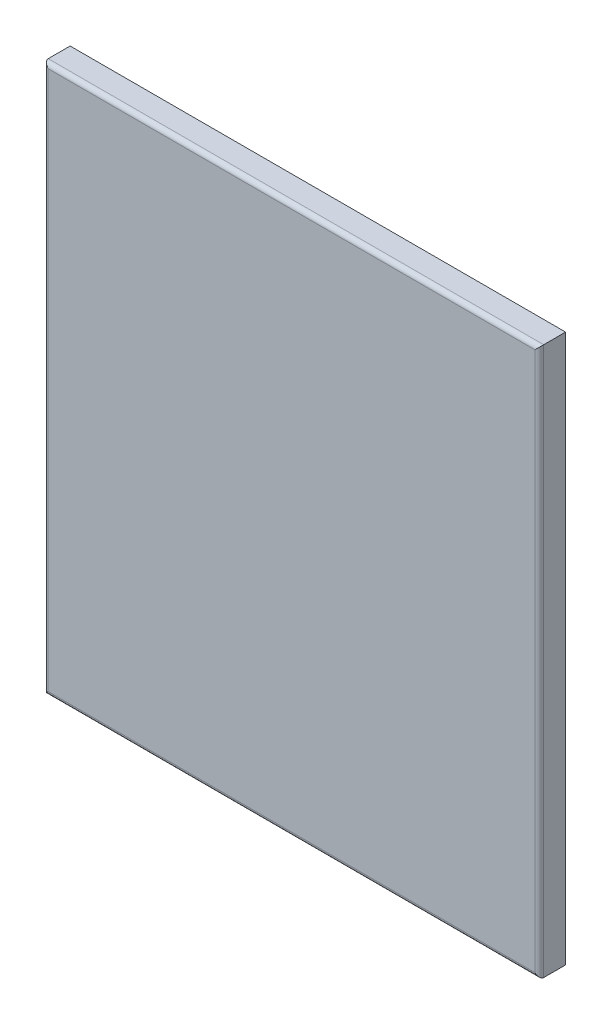
ISO-10303-21;
HEADER;
FILE_DESCRIPTION(('STEP AP214'),'2;1');
FILE_NAME('part.step','',(''),(''),'','','');
FILE_SCHEMA(('AUTOMOTIVE_DESIGN { 1 0 10303 214 1 1 1 1 }'));
ENDSEC;
DATA;
#1=APPLICATION_CONTEXT('core data for automotive mechanical design processes');
#2=APPLICATION_PROTOCOL_DEFINITION('international standard','automotive_design',2000,#1);
#3=PRODUCT_CONTEXT('',#1,'mechanical');
#4=PRODUCT('Part','Part','',(#3));
#5=PRODUCT_RELATED_PRODUCT_CATEGORY('part','',(#4));
#6=PRODUCT_DEFINITION_FORMATION('','',#4);
#7=PRODUCT_DEFINITION_CONTEXT('part definition',#1,'design');
#8=PRODUCT_DEFINITION('design','',#6,#7);
#9=PRODUCT_DEFINITION_SHAPE('','',#8);
#10=(LENGTH_UNIT() NAMED_UNIT(*) SI_UNIT(.MILLI.,.METRE.));
#11=(NAMED_UNIT(*) PLANE_ANGLE_UNIT() SI_UNIT($,.RADIAN.));
#12=(NAMED_UNIT(*) SI_UNIT($,.STERADIAN.) SOLID_ANGLE_UNIT());
#13=UNCERTAINTY_MEASURE_WITH_UNIT(LENGTH_MEASURE(1.E-05),#10,'distance_accuracy_value','');
#14=(GEOMETRIC_REPRESENTATION_CONTEXT(3) GLOBAL_UNCERTAINTY_ASSIGNED_CONTEXT((#13)) GLOBAL_UNIT_ASSIGNED_CONTEXT((#10,
#11,#12)) REPRESENTATION_CONTEXT('',''));
#15=CARTESIAN_POINT('',(0.,0.,0.));
#16=DIRECTION('',(0.,0.,1.));
#17=DIRECTION('',(1.,0.,0.));
#18=AXIS2_PLACEMENT_3D('',#15,#16,#17);
#19=CARTESIAN_POINT('',(0.,0.,0.));
#20=DIRECTION('',(0.,0.,-1.));
#21=DIRECTION('',(-1.,0.,0.));
#22=AXIS2_PLACEMENT_3D('',#19,#20,#21);
#23=PLANE('',#22);
#24=DIRECTION('',(1.,0.,0.));
#25=VECTOR('',#24,1.);
#26=CARTESIAN_POINT('',(717.55,0.,0.));
#27=LINE('',#26,#25);
#28=CARTESIAN_POINT('',(0.,0.,0.));
#29=VERTEX_POINT('',#28);
#30=CARTESIAN_POINT('',(717.55,0.,0.));
#31=VERTEX_POINT('',#30);
#32=EDGE_CURVE('E225',#29,#31,#27,.T.);
#33=ORIENTED_EDGE('',*,*,#32,.F.);
#34=DIRECTION('',(0.,-1.,0.));
#35=VECTOR('',#34,1.);
#36=CARTESIAN_POINT('',(0.,0.,0.));
#37=LINE('',#36,#35);
#38=CARTESIAN_POINT('',(0.,793.75,0.));
#39=VERTEX_POINT('',#38);
#40=EDGE_CURVE('E245',#39,#29,#37,.T.);
#41=ORIENTED_EDGE('',*,*,#40,.F.);
#42=DIRECTION('',(-1.,0.,0.));
#43=VECTOR('',#42,1.);
#44=CARTESIAN_POINT('',(0.,793.75,0.));
#45=LINE('',#44,#43);
#46=CARTESIAN_POINT('',(717.55,793.75,0.));
#47=VERTEX_POINT('',#46);
#48=EDGE_CURVE('E238',#47,#39,#45,.T.);
#49=ORIENTED_EDGE('',*,*,#48,.F.);
#50=DIRECTION('',(0.,1.,0.));
#51=VECTOR('',#50,1.);
#52=CARTESIAN_POINT('',(717.55,793.75,0.));
#53=LINE('',#52,#51);
#54=EDGE_CURVE('E231',#31,#47,#53,.T.);
#55=ORIENTED_EDGE('',*,*,#54,.F.);
#56=EDGE_LOOP('',(#33,#41,#49,#55));
#57=FACE_BOUND('',#56,.T.);
#58=DIRECTION('',(1.,0.,0.));
#59=VECTOR('',#58,1.);
#60=CARTESIAN_POINT('',(0.,25.4,0.));
#61=LINE('',#60,#59);
#62=CARTESIAN_POINT('',(25.4,25.4,0.));
#63=VERTEX_POINT('',#62);
#64=CARTESIAN_POINT('',(692.15,25.4,0.));
#65=VERTEX_POINT('',#64);
#66=EDGE_CURVE('E182',#63,#65,#61,.T.);
#67=ORIENTED_EDGE('',*,*,#66,.T.);
#68=DIRECTION('',(0.,1.,0.));
#69=VECTOR('',#68,1.);
#70=CARTESIAN_POINT('',(692.15,0.,0.));
#71=LINE('',#70,#69);
#72=CARTESIAN_POINT('',(692.15,768.35,0.));
#73=VERTEX_POINT('',#72);
#74=EDGE_CURVE('E173',#65,#73,#71,.T.);
#75=ORIENTED_EDGE('',*,*,#74,.T.);
#76=DIRECTION('',(-1.,0.,0.));
#77=VECTOR('',#76,1.);
#78=CARTESIAN_POINT('',(0.,768.35,0.));
#79=LINE('',#78,#77);
#80=CARTESIAN_POINT('',(25.4,768.35,0.));
#81=VERTEX_POINT('',#80);
#82=EDGE_CURVE('E155',#73,#81,#79,.T.);
#83=ORIENTED_EDGE('',*,*,#82,.T.);
#84=DIRECTION('',(0.,-1.,0.));
#85=VECTOR('',#84,1.);
#86=CARTESIAN_POINT('',(25.4,0.,0.));
#87=LINE('',#86,#85);
#88=EDGE_CURVE('E167',#81,#63,#87,.T.);
#89=ORIENTED_EDGE('',*,*,#88,.T.);
#90=EDGE_LOOP('',(#67,#75,#83,#89));
#91=FACE_BOUND('',#90,.T.);
#92=ADVANCED_FACE('F41',(#57,#91),#23,.T.);
#93=CARTESIAN_POINT('',(717.55,0.,38.1));
#94=DIRECTION('',(0.,1.,0.));
#95=DIRECTION('',(-1.,0.,0.));
#96=AXIS2_PLACEMENT_3D('',#93,#94,#95);
#97=PLANE('',#96);
#98=DIRECTION('',(0.,0.,-1.));
#99=VECTOR('',#98,1.);
#100=CARTESIAN_POINT('',(717.55,0.,38.1));
#101=LINE('',#100,#99);
#102=CARTESIAN_POINT('',(717.55,0.,31.75));
#103=VERTEX_POINT('',#102);
#104=EDGE_CURVE('E168',#103,#31,#101,.T.);
#105=ORIENTED_EDGE('',*,*,#104,.F.);
#106=DIRECTION('',(1.,0.,0.));
#107=VECTOR('',#106,1.);
#108=CARTESIAN_POINT('',(717.55,0.,31.75));
#109=LINE('',#108,#107);
#110=CARTESIAN_POINT('',(0.,0.,31.75));
#111=VERTEX_POINT('',#110);
#112=EDGE_CURVE('E203',#103,#111,#109,.F.);
#113=ORIENTED_EDGE('',*,*,#112,.T.);
#114=DIRECTION('',(0.,0.,-1.));
#115=VECTOR('',#114,1.);
#116=CARTESIAN_POINT('',(0.,0.,38.1));
#117=LINE('',#116,#115);
#118=EDGE_CURVE('E249',#111,#29,#117,.T.);
#119=ORIENTED_EDGE('',*,*,#118,.T.);
#120=ORIENTED_EDGE('',*,*,#32,.T.);
#121=EDGE_LOOP('',(#105,#113,#119,#120));
#122=FACE_BOUND('',#121,.T.);
#123=ADVANCED_FACE('F403',(#122),#97,.F.);
#124=CARTESIAN_POINT('',(717.55,793.75,38.1));
#125=DIRECTION('',(-1.,0.,0.));
#126=DIRECTION('',(0.,-1.,0.));
#127=AXIS2_PLACEMENT_3D('',#124,#125,#126);
#128=PLANE('',#127);
#129=DIRECTION('',(0.,0.,-1.));
#130=VECTOR('',#129,1.);
#131=CARTESIAN_POINT('',(717.55,793.75,38.1));
#132=LINE('',#131,#130);
#133=CARTESIAN_POINT('',(717.55,793.75,31.75));
#134=VERTEX_POINT('',#133);
#135=EDGE_CURVE('E255',#134,#47,#132,.T.);
#136=ORIENTED_EDGE('',*,*,#135,.F.);
#137=DIRECTION('',(0.,1.,0.));
#138=VECTOR('',#137,1.);
#139=CARTESIAN_POINT('',(717.55,793.75,31.75));
#140=LINE('',#139,#138);
#141=EDGE_CURVE('E51',#134,#103,#140,.F.);
#142=ORIENTED_EDGE('',*,*,#141,.T.);
#143=ORIENTED_EDGE('',*,*,#104,.T.);
#144=ORIENTED_EDGE('',*,*,#54,.T.);
#145=EDGE_LOOP('',(#136,#142,#143,#144));
#146=FACE_BOUND('',#145,.T.);
#147=ADVANCED_FACE('F409',(#146),#128,.F.);
#148=CARTESIAN_POINT('',(0.,793.75,38.1));
#149=DIRECTION('',(0.,-1.,0.));
#150=DIRECTION('',(0.,0.,-1.));
#151=AXIS2_PLACEMENT_3D('',#148,#149,#150);
#152=PLANE('',#151);
#153=DIRECTION('',(0.,0.,-1.));
#154=VECTOR('',#153,1.);
#155=CARTESIAN_POINT('',(0.,793.75,38.1));
#156=LINE('',#155,#154);
#157=CARTESIAN_POINT('',(0.,793.75,31.75));
#158=VERTEX_POINT('',#157);
#159=EDGE_CURVE('E252',#158,#39,#156,.T.);
#160=ORIENTED_EDGE('',*,*,#159,.F.);
#161=DIRECTION('',(-1.,0.,0.));
#162=VECTOR('',#161,1.);
#163=CARTESIAN_POINT('',(0.,793.75,31.75));
#164=LINE('',#163,#162);
#165=EDGE_CURVE('E11',#158,#134,#164,.F.);
#166=ORIENTED_EDGE('',*,*,#165,.T.);
#167=ORIENTED_EDGE('',*,*,#135,.T.);
#168=ORIENTED_EDGE('',*,*,#48,.T.);
#169=EDGE_LOOP('',(#160,#166,#167,#168));
#170=FACE_BOUND('',#169,.T.);
#171=ADVANCED_FACE('F418',(#170),#152,.F.);
#172=CARTESIAN_POINT('',(0.,0.,38.1));
#173=DIRECTION('',(1.,0.,0.));
#174=DIRECTION('',(0.,0.,-1.));
#175=AXIS2_PLACEMENT_3D('',#172,#173,#174);
#176=PLANE('',#175);
#177=ORIENTED_EDGE('',*,*,#118,.F.);
#178=DIRECTION('',(0.,-1.,0.));
#179=VECTOR('',#178,1.);
#180=CARTESIAN_POINT('',(0.,0.,31.75));
#181=LINE('',#180,#179);
#182=EDGE_CURVE('E65',#111,#158,#181,.F.);
#183=ORIENTED_EDGE('',*,*,#182,.T.);
#184=ORIENTED_EDGE('',*,*,#159,.T.);
#185=ORIENTED_EDGE('',*,*,#40,.T.);
#186=EDGE_LOOP('',(#177,#183,#184,#185));
#187=FACE_BOUND('',#186,.T.);
#188=ADVANCED_FACE('F415',(#187),#176,.F.);
#189=CARTESIAN_POINT('',(0.,0.,38.1));
#190=DIRECTION('',(0.,0.,-1.));
#191=DIRECTION('',(-1.,0.,0.));
#192=AXIS2_PLACEMENT_3D('',#189,#190,#191);
#193=PLANE('',#192);
#194=DIRECTION('',(0.,-1.,0.));
#195=VECTOR('',#194,1.);
#196=CARTESIAN_POINT('',(6.35,0.,38.1));
#197=LINE('',#196,#195);
#198=CARTESIAN_POINT('',(6.35,787.4,38.1));
#199=VERTEX_POINT('',#198);
#200=CARTESIAN_POINT('',(6.35,6.35,38.1));
#201=VERTEX_POINT('',#200);
#202=EDGE_CURVE('E196',#199,#201,#197,.T.);
#203=ORIENTED_EDGE('',*,*,#202,.T.);
#204=DIRECTION('',(1.,0.,0.));
#205=VECTOR('',#204,1.);
#206=CARTESIAN_POINT('',(0.,6.35,38.1));
#207=LINE('',#206,#205);
#208=CARTESIAN_POINT('',(711.2,6.35000000000002,38.1));
#209=VERTEX_POINT('',#208);
#210=EDGE_CURVE('E199',#201,#209,#207,.T.);
#211=ORIENTED_EDGE('',*,*,#210,.T.);
#212=DIRECTION('',(0.,1.,0.));
#213=VECTOR('',#212,1.);
#214=CARTESIAN_POINT('',(711.2,0.,38.1));
#215=LINE('',#214,#213);
#216=CARTESIAN_POINT('',(711.2,787.4,38.1));
#217=VERTEX_POINT('',#216);
#218=EDGE_CURVE('E189',#209,#217,#215,.T.);
#219=ORIENTED_EDGE('',*,*,#218,.T.);
#220=DIRECTION('',(-1.,0.,0.));
#221=VECTOR('',#220,1.);
#222=CARTESIAN_POINT('',(0.,787.4,38.1));
#223=LINE('',#222,#221);
#224=EDGE_CURVE('E184',#217,#199,#223,.T.);
#225=ORIENTED_EDGE('',*,*,#224,.T.);
#226=EDGE_LOOP('',(#203,#211,#219,#225));
#227=FACE_BOUND('',#226,.T.);
#228=ADVANCED_FACE('F413',(#227),#193,.F.);
#229=CARTESIAN_POINT('',(0.,787.4,31.75));
#230=DIRECTION('',(-1.,0.,0.));
#231=DIRECTION('',(0.,0.,1.));
#232=AXIS2_PLACEMENT_3D('',#229,#230,#231);
#233=CYLINDRICAL_SURFACE('',#232,6.35);
#234=CARTESIAN_POINT('',(711.2,787.4,31.75));
#235=DIRECTION('',(-0.707106781186548,0.707106781186547,0.));
#236=DIRECTION('',(-0.707106781186547,-0.707106781186548,0.));
#237=AXIS2_PLACEMENT_3D('',#234,#235,#236);
#238=ELLIPSE('',#237,8.98025612106915,6.35);
#239=EDGE_CURVE('E216',#134,#217,#238,.F.);
#240=ORIENTED_EDGE('',*,*,#239,.F.);
#241=ORIENTED_EDGE('',*,*,#165,.F.);
#242=CARTESIAN_POINT('',(6.35,787.4,31.75));
#243=DIRECTION('',(-0.707106781186547,-0.707106781186547,0.));
#244=DIRECTION('',(-0.707106781186547,0.707106781186547,0.));
#245=AXIS2_PLACEMENT_3D('',#242,#243,#244);
#246=ELLIPSE('',#245,8.98025612106915,6.35);
#247=EDGE_CURVE('E45',#199,#158,#246,.T.);
#248=ORIENTED_EDGE('',*,*,#247,.F.);
#249=ORIENTED_EDGE('',*,*,#224,.F.);
#250=EDGE_LOOP('',(#240,#241,#248,#249));
#251=FACE_BOUND('',#250,.T.);
#252=ADVANCED_FACE('F43',(#251),#233,.T.);
#253=CARTESIAN_POINT('',(6.35,0.,31.75));
#254=DIRECTION('',(0.,-1.,0.));
#255=DIRECTION('',(0.,0.,-1.));
#256=AXIS2_PLACEMENT_3D('',#253,#254,#255);
#257=CYLINDRICAL_SURFACE('',#256,6.35);
#258=ORIENTED_EDGE('',*,*,#247,.T.);
#259=ORIENTED_EDGE('',*,*,#182,.F.);
#260=CARTESIAN_POINT('',(6.35,6.35,31.75));
#261=DIRECTION('',(0.707106781186547,-0.707106781186547,0.));
#262=DIRECTION('',(-0.707106781186547,-0.707106781186547,0.));
#263=AXIS2_PLACEMENT_3D('',#260,#261,#262);
#264=ELLIPSE('',#263,8.98025612106915,6.35);
#265=EDGE_CURVE('E214',#201,#111,#264,.T.);
#266=ORIENTED_EDGE('',*,*,#265,.F.);
#267=ORIENTED_EDGE('',*,*,#202,.F.);
#268=EDGE_LOOP('',(#258,#259,#266,#267));
#269=FACE_BOUND('',#268,.T.);
#270=ADVANCED_FACE('F430',(#269),#257,.T.);
#271=CARTESIAN_POINT('',(711.2,0.,31.75));
#272=DIRECTION('',(0.,1.,0.));
#273=DIRECTION('',(-1.,0.,0.));
#274=AXIS2_PLACEMENT_3D('',#271,#272,#273);
#275=CYLINDRICAL_SURFACE('',#274,6.35);
#276=ORIENTED_EDGE('',*,*,#239,.T.);
#277=ORIENTED_EDGE('',*,*,#218,.F.);
#278=CARTESIAN_POINT('',(711.2,6.35000000000002,31.75));
#279=DIRECTION('',(0.707106781186547,0.707106781186548,0.));
#280=DIRECTION('',(-0.707106781186548,0.707106781186547,0.));
#281=AXIS2_PLACEMENT_3D('',#278,#279,#280);
#282=ELLIPSE('',#281,8.98025612106915,6.35);
#283=EDGE_CURVE('E211',#103,#209,#282,.F.);
#284=ORIENTED_EDGE('',*,*,#283,.F.);
#285=ORIENTED_EDGE('',*,*,#141,.F.);
#286=EDGE_LOOP('',(#276,#277,#284,#285));
#287=FACE_BOUND('',#286,.T.);
#288=ADVANCED_FACE('F427',(#287),#275,.T.);
#289=CARTESIAN_POINT('',(0.,6.35,31.75));
#290=DIRECTION('',(1.,0.,0.));
#291=DIRECTION('',(0.,1.,0.));
#292=AXIS2_PLACEMENT_3D('',#289,#290,#291);
#293=CYLINDRICAL_SURFACE('',#292,6.35);
#294=ORIENTED_EDGE('',*,*,#265,.T.);
#295=ORIENTED_EDGE('',*,*,#112,.F.);
#296=ORIENTED_EDGE('',*,*,#283,.T.);
#297=ORIENTED_EDGE('',*,*,#210,.F.);
#298=EDGE_LOOP('',(#294,#295,#296,#297));
#299=FACE_BOUND('',#298,.T.);
#300=ADVANCED_FACE('F424',(#299),#293,.T.);
#301=CARTESIAN_POINT('',(0.,768.35,0.));
#302=DIRECTION('',(0.,-1.,0.));
#303=DIRECTION('',(-1.,0.,0.));
#304=AXIS2_PLACEMENT_3D('',#301,#302,#303);
#305=PLANE('',#304);
#306=ORIENTED_EDGE('',*,*,#82,.F.);
#307=DIRECTION('',(0.,0.,1.));
#308=VECTOR('',#307,1.);
#309=CARTESIAN_POINT('',(692.15,768.35,0.));
#310=LINE('',#309,#308);
#311=CARTESIAN_POINT('',(692.15,768.35,1.5875));
#312=VERTEX_POINT('',#311);
#313=EDGE_CURVE('E159',#312,#73,#310,.F.);
#314=ORIENTED_EDGE('',*,*,#313,.F.);
#315=DIRECTION('',(1.,0.,0.));
#316=VECTOR('',#315,1.);
#317=CARTESIAN_POINT('',(0.,768.35,1.5875));
#318=LINE('',#317,#316);
#319=CARTESIAN_POINT('',(25.4,768.35,1.5875));
#320=VERTEX_POINT('',#319);
#321=EDGE_CURVE('E179',#312,#320,#318,.F.);
#322=ORIENTED_EDGE('',*,*,#321,.T.);
#323=DIRECTION('',(0.,0.,1.));
#324=VECTOR('',#323,1.);
#325=CARTESIAN_POINT('',(25.4,768.35,0.));
#326=LINE('',#325,#324);
#327=EDGE_CURVE('E161',#320,#81,#326,.F.);
#328=ORIENTED_EDGE('',*,*,#327,.T.);
#329=EDGE_LOOP('',(#306,#314,#322,#328));
#330=FACE_BOUND('',#329,.T.);
#331=ADVANCED_FACE('F157',(#330),#305,.T.);
#332=CARTESIAN_POINT('',(25.4,0.,0.));
#333=DIRECTION('',(1.,0.,0.));
#334=DIRECTION('',(0.,-1.,0.));
#335=AXIS2_PLACEMENT_3D('',#332,#333,#334);
#336=PLANE('',#335);
#337=ORIENTED_EDGE('',*,*,#88,.F.);
#338=ORIENTED_EDGE('',*,*,#327,.F.);
#339=DIRECTION('',(0.,1.,0.));
#340=VECTOR('',#339,1.);
#341=CARTESIAN_POINT('',(25.4,0.,1.5875));
#342=LINE('',#341,#340);
#343=CARTESIAN_POINT('',(25.4,25.4,1.5875));
#344=VERTEX_POINT('',#343);
#345=EDGE_CURVE('E267',#320,#344,#342,.F.);
#346=ORIENTED_EDGE('',*,*,#345,.T.);
#347=DIRECTION('',(0.,0.,1.));
#348=VECTOR('',#347,1.);
#349=CARTESIAN_POINT('',(25.4,25.4,0.));
#350=LINE('',#349,#348);
#351=EDGE_CURVE('E266',#344,#63,#350,.F.);
#352=ORIENTED_EDGE('',*,*,#351,.T.);
#353=EDGE_LOOP('',(#337,#338,#346,#352));
#354=FACE_BOUND('',#353,.T.);
#355=ADVANCED_FACE('F263',(#354),#336,.T.);
#356=CARTESIAN_POINT('',(0.,25.4,0.));
#357=DIRECTION('',(0.,1.,0.));
#358=DIRECTION('',(1.,0.,0.));
#359=AXIS2_PLACEMENT_3D('',#356,#357,#358);
#360=PLANE('',#359);
#361=ORIENTED_EDGE('',*,*,#66,.F.);
#362=ORIENTED_EDGE('',*,*,#351,.F.);
#363=DIRECTION('',(-1.,0.,0.));
#364=VECTOR('',#363,1.);
#365=CARTESIAN_POINT('',(0.,25.4,1.5875));
#366=LINE('',#365,#364);
#367=CARTESIAN_POINT('',(692.15,25.4,1.5875));
#368=VERTEX_POINT('',#367);
#369=EDGE_CURVE('E279',#344,#368,#366,.F.);
#370=ORIENTED_EDGE('',*,*,#369,.T.);
#371=DIRECTION('',(0.,0.,1.));
#372=VECTOR('',#371,1.);
#373=CARTESIAN_POINT('',(692.15,25.4,0.));
#374=LINE('',#373,#372);
#375=EDGE_CURVE('E178',#368,#65,#374,.F.);
#376=ORIENTED_EDGE('',*,*,#375,.T.);
#377=EDGE_LOOP('',(#361,#362,#370,#376));
#378=FACE_BOUND('',#377,.T.);
#379=ADVANCED_FACE('F576',(#378),#360,.T.);
#380=CARTESIAN_POINT('',(692.15,0.,0.));
#381=DIRECTION('',(-1.,0.,0.));
#382=DIRECTION('',(0.,1.,0.));
#383=AXIS2_PLACEMENT_3D('',#380,#381,#382);
#384=PLANE('',#383);
#385=ORIENTED_EDGE('',*,*,#74,.F.);
#386=ORIENTED_EDGE('',*,*,#375,.F.);
#387=DIRECTION('',(0.,-1.,0.));
#388=VECTOR('',#387,1.);
#389=CARTESIAN_POINT('',(692.15,0.,1.5875));
#390=LINE('',#389,#388);
#391=EDGE_CURVE('E176',#368,#312,#390,.F.);
#392=ORIENTED_EDGE('',*,*,#391,.T.);
#393=ORIENTED_EDGE('',*,*,#313,.T.);
#394=EDGE_LOOP('',(#385,#386,#392,#393));
#395=FACE_BOUND('',#394,.T.);
#396=ADVANCED_FACE('F172',(#395),#384,.T.);
#397=CARTESIAN_POINT('',(0.,0.,1.5875));
#398=DIRECTION('',(0.,0.,-1.));
#399=DIRECTION('',(-1.,0.,0.));
#400=AXIS2_PLACEMENT_3D('',#397,#398,#399);
#401=PLANE('',#400);
#402=DIRECTION('',(1.,0.,0.));
#403=VECTOR('',#402,1.);
#404=CARTESIAN_POINT('',(0.,1.5875,1.5875));
#405=LINE('',#404,#403);
#406=CARTESIAN_POINT('',(1.5875,1.5875,1.5875));
#407=VERTEX_POINT('',#406);
#408=CARTESIAN_POINT('',(715.9625,1.58750000000002,1.5875));
#409=VERTEX_POINT('',#408);
#410=EDGE_CURVE('E313',#407,#409,#405,.T.);
#411=ORIENTED_EDGE('',*,*,#410,.T.);
#412=DIRECTION('',(0.,1.,0.));
#413=VECTOR('',#412,1.);
#414=CARTESIAN_POINT('',(715.9625,1.00142116821189E-13,1.5875));
#415=LINE('',#414,#413);
#416=CARTESIAN_POINT('',(715.9625,792.1625,1.5875));
#417=VERTEX_POINT('',#416);
#418=EDGE_CURVE('E340',#409,#417,#415,.T.);
#419=ORIENTED_EDGE('',*,*,#418,.T.);
#420=DIRECTION('',(-1.,0.,0.));
#421=VECTOR('',#420,1.);
#422=CARTESIAN_POINT('',(0.,792.1625,1.5875));
#423=LINE('',#422,#421);
#424=CARTESIAN_POINT('',(1.5875,792.1625,1.5875));
#425=VERTEX_POINT('',#424);
#426=EDGE_CURVE('E344',#417,#425,#423,.T.);
#427=ORIENTED_EDGE('',*,*,#426,.T.);
#428=DIRECTION('',(0.,-1.,0.));
#429=VECTOR('',#428,1.);
#430=CARTESIAN_POINT('',(1.5875,0.,1.5875));
#431=LINE('',#430,#429);
#432=EDGE_CURVE('E334',#425,#407,#431,.T.);
#433=ORIENTED_EDGE('',*,*,#432,.T.);
#434=EDGE_LOOP('',(#411,#419,#427,#433));
#435=FACE_BOUND('',#434,.T.);
#436=ORIENTED_EDGE('',*,*,#369,.F.);
#437=ORIENTED_EDGE('',*,*,#345,.F.);
#438=ORIENTED_EDGE('',*,*,#321,.F.);
#439=ORIENTED_EDGE('',*,*,#391,.F.);
#440=EDGE_LOOP('',(#436,#437,#438,#439));
#441=FACE_BOUND('',#440,.T.);
#442=ADVANCED_FACE('F355',(#435,#441),#401,.F.);
#443=CARTESIAN_POINT('',(717.55,1.58750000000002,38.1));
#444=DIRECTION('',(0.,1.,0.));
#445=DIRECTION('',(-1.,0.,0.));
#446=AXIS2_PLACEMENT_3D('',#443,#444,#445);
#447=PLANE('',#446);
#448=DIRECTION('',(0.,0.,-1.));
#449=VECTOR('',#448,1.);
#450=CARTESIAN_POINT('',(715.9625,1.58750000000007,38.1));
#451=LINE('',#450,#449);
#452=CARTESIAN_POINT('',(715.9625,1.58750000000005,31.75));
#453=VERTEX_POINT('',#452);
#454=EDGE_CURVE('E308',#453,#409,#451,.T.);
#455=ORIENTED_EDGE('',*,*,#454,.T.);
#456=ORIENTED_EDGE('',*,*,#410,.F.);
#457=DIRECTION('',(0.,0.,-1.));
#458=VECTOR('',#457,1.);
#459=CARTESIAN_POINT('',(1.58749999999996,1.5875,38.1));
#460=LINE('',#459,#458);
#461=CARTESIAN_POINT('',(1.58749999999998,1.5875,31.75));
#462=VERTEX_POINT('',#461);
#463=EDGE_CURVE('E327',#462,#407,#460,.T.);
#464=ORIENTED_EDGE('',*,*,#463,.F.);
#465=DIRECTION('',(-1.,0.,0.));
#466=VECTOR('',#465,1.);
#467=CARTESIAN_POINT('',(717.55,1.58750000000002,31.75));
#468=LINE('',#467,#466);
#469=EDGE_CURVE('E303',#453,#462,#468,.T.);
#470=ORIENTED_EDGE('',*,*,#469,.F.);
#471=EDGE_LOOP('',(#455,#456,#464,#470));
#472=FACE_BOUND('',#471,.T.);
#473=ADVANCED_FACE('F362',(#472),#447,.T.);
#474=CARTESIAN_POINT('',(715.9625,793.75,38.1));
#475=DIRECTION('',(-1.,0.,0.));
#476=DIRECTION('',(0.,-1.,0.));
#477=AXIS2_PLACEMENT_3D('',#474,#475,#476);
#478=PLANE('',#477);
#479=DIRECTION('',(0.,0.,-1.));
#480=VECTOR('',#479,1.);
#481=CARTESIAN_POINT('',(715.9625,792.1625,38.1));
#482=LINE('',#481,#480);
#483=CARTESIAN_POINT('',(715.9625,792.1625,31.75));
#484=VERTEX_POINT('',#483);
#485=EDGE_CURVE('E326',#484,#417,#482,.T.);
#486=ORIENTED_EDGE('',*,*,#485,.T.);
#487=ORIENTED_EDGE('',*,*,#418,.F.);
#488=ORIENTED_EDGE('',*,*,#454,.F.);
#489=DIRECTION('',(0.,-1.,0.));
#490=VECTOR('',#489,1.);
#491=CARTESIAN_POINT('',(715.9625,793.75,31.75));
#492=LINE('',#491,#490);
#493=EDGE_CURVE('E320',#484,#453,#492,.T.);
#494=ORIENTED_EDGE('',*,*,#493,.F.);
#495=EDGE_LOOP('',(#486,#487,#488,#494));
#496=FACE_BOUND('',#495,.T.);
#497=ADVANCED_FACE('F368',(#496),#478,.T.);
#498=CARTESIAN_POINT('',(0.,792.1625,38.1));
#499=DIRECTION('',(0.,-1.,0.));
#500=DIRECTION('',(0.,0.,-1.));
#501=AXIS2_PLACEMENT_3D('',#498,#499,#500);
#502=PLANE('',#501);
#503=DIRECTION('',(0.,0.,-1.));
#504=VECTOR('',#503,1.);
#505=CARTESIAN_POINT('',(1.5875,792.1625,38.1));
#506=LINE('',#505,#504);
#507=CARTESIAN_POINT('',(1.5875,792.1625,31.75));
#508=VERTEX_POINT('',#507);
#509=EDGE_CURVE('E323',#508,#425,#506,.T.);
#510=ORIENTED_EDGE('',*,*,#509,.T.);
#511=ORIENTED_EDGE('',*,*,#426,.F.);
#512=ORIENTED_EDGE('',*,*,#485,.F.);
#513=DIRECTION('',(1.,0.,0.));
#514=VECTOR('',#513,1.);
#515=CARTESIAN_POINT('',(0.,792.1625,31.75));
#516=LINE('',#515,#514);
#517=EDGE_CURVE('E280',#508,#484,#516,.T.);
#518=ORIENTED_EDGE('',*,*,#517,.F.);
#519=EDGE_LOOP('',(#510,#511,#512,#518));
#520=FACE_BOUND('',#519,.T.);
#521=ADVANCED_FACE('F373',(#520),#502,.T.);
#522=CARTESIAN_POINT('',(1.5875,0.,38.1));
#523=DIRECTION('',(1.,0.,0.));
#524=DIRECTION('',(0.,0.,-1.));
#525=AXIS2_PLACEMENT_3D('',#522,#523,#524);
#526=PLANE('',#525);
#527=ORIENTED_EDGE('',*,*,#463,.T.);
#528=ORIENTED_EDGE('',*,*,#432,.F.);
#529=ORIENTED_EDGE('',*,*,#509,.F.);
#530=DIRECTION('',(0.,1.,0.));
#531=VECTOR('',#530,1.);
#532=CARTESIAN_POINT('',(1.5875,0.,31.75));
#533=LINE('',#532,#531);
#534=EDGE_CURVE('E317',#462,#508,#533,.T.);
#535=ORIENTED_EDGE('',*,*,#534,.F.);
#536=EDGE_LOOP('',(#527,#528,#529,#535));
#537=FACE_BOUND('',#536,.T.);
#538=ADVANCED_FACE('F393',(#537),#526,.T.);
#539=CARTESIAN_POINT('',(0.,0.,36.5125));
#540=DIRECTION('',(0.,0.,-1.));
#541=DIRECTION('',(-1.,0.,0.));
#542=AXIS2_PLACEMENT_3D('',#539,#540,#541);
#543=PLANE('',#542);
#544=DIRECTION('',(0.,1.,0.));
#545=VECTOR('',#544,1.);
#546=CARTESIAN_POINT('',(6.35,0.,36.5125));
#547=LINE('',#546,#545);
#548=CARTESIAN_POINT('',(6.35,787.4,36.5125));
#549=VERTEX_POINT('',#548);
#550=CARTESIAN_POINT('',(6.35,6.35,36.5125));
#551=VERTEX_POINT('',#550);
#552=EDGE_CURVE('E297',#549,#551,#547,.F.);
#553=ORIENTED_EDGE('',*,*,#552,.F.);
#554=DIRECTION('',(-1.,0.,0.));
#555=VECTOR('',#554,1.);
#556=CARTESIAN_POINT('',(0.,787.4,36.5125));
#557=LINE('',#556,#555);
#558=CARTESIAN_POINT('',(711.2,787.4,36.5125));
#559=VERTEX_POINT('',#558);
#560=EDGE_CURVE('E298',#559,#549,#557,.T.);
#561=ORIENTED_EDGE('',*,*,#560,.F.);
#562=DIRECTION('',(0.,1.,0.));
#563=VECTOR('',#562,1.);
#564=CARTESIAN_POINT('',(711.2,0.,36.5125));
#565=LINE('',#564,#563);
#566=CARTESIAN_POINT('',(711.2,6.35000000000002,36.5125));
#567=VERTEX_POINT('',#566);
#568=EDGE_CURVE('E294',#567,#559,#565,.T.);
#569=ORIENTED_EDGE('',*,*,#568,.F.);
#570=DIRECTION('',(-1.,0.,0.));
#571=VECTOR('',#570,1.);
#572=CARTESIAN_POINT('',(0.,6.35,36.5125));
#573=LINE('',#572,#571);
#574=EDGE_CURVE('E299',#551,#567,#573,.F.);
#575=ORIENTED_EDGE('',*,*,#574,.F.);
#576=EDGE_LOOP('',(#553,#561,#569,#575));
#577=FACE_BOUND('',#576,.T.);
#578=ADVANCED_FACE('F389',(#577),#543,.T.);
#579=CARTESIAN_POINT('',(0.,787.4,31.75));
#580=DIRECTION('',(-1.,0.,0.));
#581=DIRECTION('',(0.,0.,1.));
#582=AXIS2_PLACEMENT_3D('',#579,#580,#581);
#583=CYLINDRICAL_SURFACE('',#582,4.7625);
#584=CARTESIAN_POINT('',(711.2,787.4,31.75));
#585=DIRECTION('',(-0.707106781186548,0.707106781186547,0.));
#586=DIRECTION('',(0.707106781186547,0.707106781186548,0.));
#587=AXIS2_PLACEMENT_3D('',#584,#585,#586);
#588=ELLIPSE('',#587,6.73519209080186,4.7625);
#589=EDGE_CURVE('E293',#484,#559,#588,.F.);
#590=ORIENTED_EDGE('',*,*,#589,.T.);
#591=ORIENTED_EDGE('',*,*,#560,.T.);
#592=CARTESIAN_POINT('',(6.35,787.4,31.75));
#593=DIRECTION('',(-0.707106781186547,-0.707106781186547,0.));
#594=DIRECTION('',(0.707106781186547,-0.707106781186547,0.));
#595=AXIS2_PLACEMENT_3D('',#592,#593,#594);
#596=ELLIPSE('',#595,6.73519209080186,4.7625);
#597=EDGE_CURVE('E309',#549,#508,#596,.T.);
#598=ORIENTED_EDGE('',*,*,#597,.T.);
#599=ORIENTED_EDGE('',*,*,#517,.T.);
#600=EDGE_LOOP('',(#590,#591,#598,#599));
#601=FACE_BOUND('',#600,.T.);
#602=ADVANCED_FACE('F379',(#601),#583,.F.);
#603=CARTESIAN_POINT('',(6.35,0.,31.75));
#604=DIRECTION('',(0.,-1.,0.));
#605=DIRECTION('',(0.,0.,-1.));
#606=AXIS2_PLACEMENT_3D('',#603,#604,#605);
#607=CYLINDRICAL_SURFACE('',#606,4.7625);
#608=ORIENTED_EDGE('',*,*,#597,.F.);
#609=ORIENTED_EDGE('',*,*,#552,.T.);
#610=CARTESIAN_POINT('',(6.35,6.35,31.75));
#611=DIRECTION('',(0.707106781186547,-0.707106781186547,0.));
#612=DIRECTION('',(0.707106781186547,0.707106781186547,0.));
#613=AXIS2_PLACEMENT_3D('',#610,#611,#612);
#614=ELLIPSE('',#613,6.73519209080186,4.7625);
#615=EDGE_CURVE('E290',#551,#462,#614,.T.);
#616=ORIENTED_EDGE('',*,*,#615,.T.);
#617=ORIENTED_EDGE('',*,*,#534,.T.);
#618=EDGE_LOOP('',(#608,#609,#616,#617));
#619=FACE_BOUND('',#618,.T.);
#620=ADVANCED_FACE('F383',(#619),#607,.F.);
#621=CARTESIAN_POINT('',(711.2,0.,31.75));
#622=DIRECTION('',(0.,1.,0.));
#623=DIRECTION('',(-1.,0.,0.));
#624=AXIS2_PLACEMENT_3D('',#621,#622,#623);
#625=CYLINDRICAL_SURFACE('',#624,4.7625);
#626=ORIENTED_EDGE('',*,*,#589,.F.);
#627=ORIENTED_EDGE('',*,*,#493,.T.);
#628=CARTESIAN_POINT('',(711.2,6.35000000000002,31.75));
#629=DIRECTION('',(0.707106781186547,0.707106781186548,0.));
#630=DIRECTION('',(0.707106781186548,-0.707106781186547,0.));
#631=AXIS2_PLACEMENT_3D('',#628,#629,#630);
#632=ELLIPSE('',#631,6.73519209080187,4.7625);
#633=EDGE_CURVE('E287',#453,#567,#632,.F.);
#634=ORIENTED_EDGE('',*,*,#633,.T.);
#635=ORIENTED_EDGE('',*,*,#568,.T.);
#636=EDGE_LOOP('',(#626,#627,#634,#635));
#637=FACE_BOUND('',#636,.T.);
#638=ADVANCED_FACE('F375',(#637),#625,.F.);
#639=CARTESIAN_POINT('',(0.,6.35,31.75));
#640=DIRECTION('',(1.,0.,0.));
#641=DIRECTION('',(0.,1.,0.));
#642=AXIS2_PLACEMENT_3D('',#639,#640,#641);
#643=CYLINDRICAL_SURFACE('',#642,4.7625);
#644=ORIENTED_EDGE('',*,*,#615,.F.);
#645=ORIENTED_EDGE('',*,*,#574,.T.);
#646=ORIENTED_EDGE('',*,*,#633,.F.);
#647=ORIENTED_EDGE('',*,*,#469,.T.);
#648=EDGE_LOOP('',(#644,#645,#646,#647));
#649=FACE_BOUND('',#648,.T.);
#650=ADVANCED_FACE('F391',(#649),#643,.F.);
#651=CLOSED_SHELL('',(#92,#123,#147,#171,#188,#228,#252,#270,#288,#300,#331,#355,#379,#396,#442,
#473,#497,#521,#538,#578,#602,#620,#638,#650));
#652=MANIFOLD_SOLID_BREP('B2',#651);
#653=ADVANCED_BREP_SHAPE_REPRESENTATION('',(#18,#652),#14);
#654=SHAPE_DEFINITION_REPRESENTATION(#9,#653);
ENDSEC;
END-ISO-10303-21;
